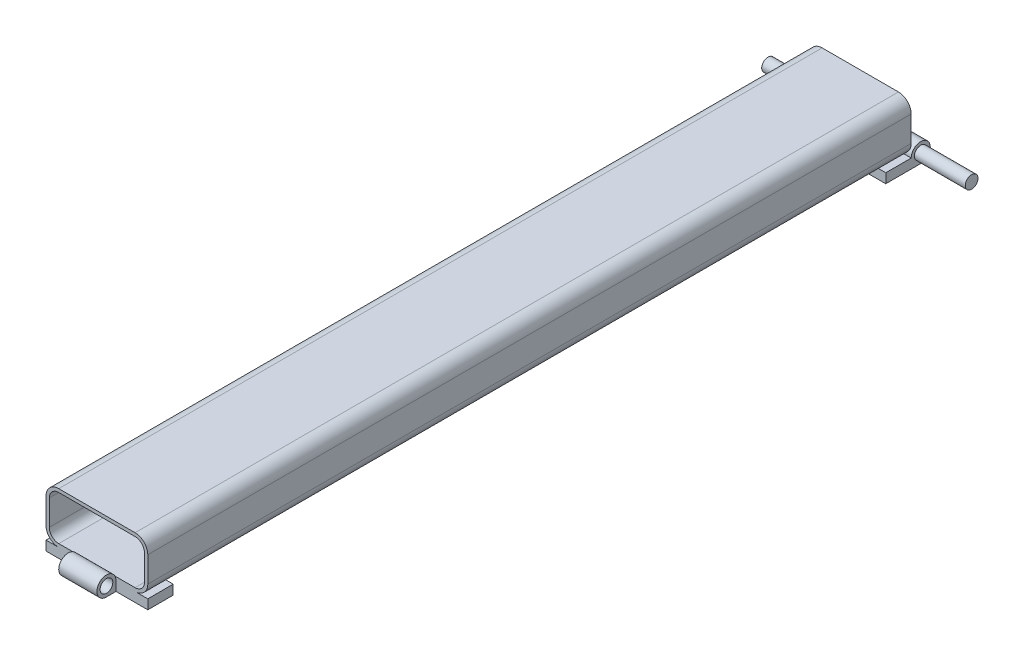
ISO-10303-21;
HEADER;
FILE_DESCRIPTION(('STEP AP214'),'2;1');
FILE_NAME('part.step','',(''),(''),'','','');
FILE_SCHEMA(('AUTOMOTIVE_DESIGN { 1 0 10303 214 1 1 1 1 }'));
ENDSEC;
DATA;
#1=APPLICATION_CONTEXT('core data for automotive mechanical design processes');
#2=APPLICATION_PROTOCOL_DEFINITION('international standard','automotive_design',2000,#1);
#3=PRODUCT_CONTEXT('',#1,'mechanical');
#4=PRODUCT('Part','Part','',(#3));
#5=PRODUCT_RELATED_PRODUCT_CATEGORY('part','',(#4));
#6=PRODUCT_DEFINITION_FORMATION('','',#4);
#7=PRODUCT_DEFINITION_CONTEXT('part definition',#1,'design');
#8=PRODUCT_DEFINITION('design','',#6,#7);
#9=PRODUCT_DEFINITION_SHAPE('','',#8);
#10=(LENGTH_UNIT() NAMED_UNIT(*) SI_UNIT(.MILLI.,.METRE.));
#11=(NAMED_UNIT(*) PLANE_ANGLE_UNIT() SI_UNIT($,.RADIAN.));
#12=(NAMED_UNIT(*) SI_UNIT($,.STERADIAN.) SOLID_ANGLE_UNIT());
#13=UNCERTAINTY_MEASURE_WITH_UNIT(LENGTH_MEASURE(1.E-05),#10,'distance_accuracy_value','');
#14=(GEOMETRIC_REPRESENTATION_CONTEXT(3) GLOBAL_UNCERTAINTY_ASSIGNED_CONTEXT((#13)) GLOBAL_UNIT_ASSIGNED_CONTEXT((#10,
#11,#12)) REPRESENTATION_CONTEXT('',''));
#15=CARTESIAN_POINT('',(0.,0.,0.));
#16=DIRECTION('',(0.,0.,1.));
#17=DIRECTION('',(1.,0.,0.));
#18=AXIS2_PLACEMENT_3D('',#15,#16,#17);
#19=CARTESIAN_POINT('',(-19.05,-12.7,190.5));
#20=DIRECTION('',(0.,1.,0.));
#21=DIRECTION('',(0.,0.,1.));
#22=AXIS2_PLACEMENT_3D('',#19,#20,#21);
#23=PLANE('',#22);
#24=DIRECTION('',(1.,0.,0.));
#25=VECTOR('',#24,1.);
#26=CARTESIAN_POINT('',(-25.4,-12.7,177.8));
#27=LINE('',#26,#25);
#28=CARTESIAN_POINT('',(-19.05,-12.7,177.8));
#29=VERTEX_POINT('',#28);
#30=CARTESIAN_POINT('',(19.05,-12.7,177.8));
#31=VERTEX_POINT('',#30);
#32=EDGE_CURVE('E56',#29,#31,#27,.T.);
#33=ORIENTED_EDGE('',*,*,#32,.F.);
#34=DIRECTION('',(0.,0.,-1.));
#35=VECTOR('',#34,1.);
#36=CARTESIAN_POINT('',(-19.05,-12.7,190.5));
#37=LINE('',#36,#35);
#38=CARTESIAN_POINT('',(-19.05,-12.7,-177.8));
#39=VERTEX_POINT('',#38);
#40=EDGE_CURVE('E429',#29,#39,#37,.T.);
#41=ORIENTED_EDGE('',*,*,#40,.T.);
#42=DIRECTION('',(1.,0.,0.));
#43=VECTOR('',#42,1.);
#44=CARTESIAN_POINT('',(-25.4,-12.7,-177.8));
#45=LINE('',#44,#43);
#46=CARTESIAN_POINT('',(19.05,-12.7,-177.8));
#47=VERTEX_POINT('',#46);
#48=EDGE_CURVE('E312',#39,#47,#45,.T.);
#49=ORIENTED_EDGE('',*,*,#48,.T.);
#50=DIRECTION('',(0.,0.,-1.));
#51=VECTOR('',#50,1.);
#52=CARTESIAN_POINT('',(19.05,-12.7,190.5));
#53=LINE('',#52,#51);
#54=EDGE_CURVE('E430',#31,#47,#53,.T.);
#55=ORIENTED_EDGE('',*,*,#54,.F.);
#56=EDGE_LOOP('',(#33,#41,#49,#55));
#57=FACE_BOUND('',#56,.T.);
#58=ADVANCED_FACE('F32',(#57),#23,.F.);
#59=CARTESIAN_POINT('',(-19.05,-6.35,190.5));
#60=DIRECTION('',(0.,0.,-1.));
#61=DIRECTION('',(-1.,0.,0.));
#62=AXIS2_PLACEMENT_3D('',#59,#60,#61);
#63=PLANE('',#62);
#64=CARTESIAN_POINT('',(-19.05,6.35,190.5));
#65=DIRECTION('',(0.,0.,1.));
#66=DIRECTION('',(-1.,0.,0.));
#67=AXIS2_PLACEMENT_3D('',#64,#65,#66);
#68=CIRCLE('',#67,4.699);
#69=CARTESIAN_POINT('',(-19.05,11.049,190.5));
#70=VERTEX_POINT('',#69);
#71=CARTESIAN_POINT('',(-23.749,6.35,190.5));
#72=VERTEX_POINT('',#71);
#73=EDGE_CURVE('E315',#70,#72,#68,.T.);
#74=ORIENTED_EDGE('',*,*,#73,.F.);
#75=DIRECTION('',(-1.,0.,0.));
#76=VECTOR('',#75,1.);
#77=CARTESIAN_POINT('',(-19.05,11.049,190.5));
#78=LINE('',#77,#76);
#79=CARTESIAN_POINT('',(19.05,11.049,190.5));
#80=VERTEX_POINT('',#79);
#81=EDGE_CURVE('E331',#80,#70,#78,.T.);
#82=ORIENTED_EDGE('',*,*,#81,.F.);
#83=CARTESIAN_POINT('',(19.05,6.35,190.5));
#84=DIRECTION('',(0.,0.,1.));
#85=DIRECTION('',(-1.,0.,0.));
#86=AXIS2_PLACEMENT_3D('',#83,#84,#85);
#87=CIRCLE('',#86,4.699);
#88=CARTESIAN_POINT('',(23.749,6.35,190.5));
#89=VERTEX_POINT('',#88);
#90=EDGE_CURVE('E328',#89,#80,#87,.T.);
#91=ORIENTED_EDGE('',*,*,#90,.F.);
#92=DIRECTION('',(0.,1.,0.));
#93=VECTOR('',#92,1.);
#94=CARTESIAN_POINT('',(23.749,-6.35,190.5));
#95=LINE('',#94,#93);
#96=CARTESIAN_POINT('',(23.749,-6.35,190.5));
#97=VERTEX_POINT('',#96);
#98=EDGE_CURVE('E326',#97,#89,#95,.T.);
#99=ORIENTED_EDGE('',*,*,#98,.F.);
#100=CARTESIAN_POINT('',(19.05,-6.35,190.5));
#101=DIRECTION('',(0.,0.,1.));
#102=DIRECTION('',(1.,0.,0.));
#103=AXIS2_PLACEMENT_3D('',#100,#101,#102);
#104=CIRCLE('',#103,4.699);
#105=CARTESIAN_POINT('',(19.05,-11.049,190.5));
#106=VERTEX_POINT('',#105);
#107=EDGE_CURVE('E324',#106,#97,#104,.T.);
#108=ORIENTED_EDGE('',*,*,#107,.F.);
#109=DIRECTION('',(1.,0.,0.));
#110=VECTOR('',#109,1.);
#111=CARTESIAN_POINT('',(-19.05,-11.049,190.5));
#112=LINE('',#111,#110);
#113=CARTESIAN_POINT('',(-19.05,-11.049,190.5));
#114=VERTEX_POINT('',#113);
#115=EDGE_CURVE('E322',#114,#106,#112,.T.);
#116=ORIENTED_EDGE('',*,*,#115,.F.);
#117=CARTESIAN_POINT('',(-19.05,-6.35,190.5));
#118=DIRECTION('',(0.,0.,1.));
#119=DIRECTION('',(-1.,0.,0.));
#120=AXIS2_PLACEMENT_3D('',#117,#118,#119);
#121=CIRCLE('',#120,4.699);
#122=CARTESIAN_POINT('',(-23.749,-6.35,190.5));
#123=VERTEX_POINT('',#122);
#124=EDGE_CURVE('E320',#123,#114,#121,.T.);
#125=ORIENTED_EDGE('',*,*,#124,.F.);
#126=DIRECTION('',(0.,-1.,0.));
#127=VECTOR('',#126,1.);
#128=CARTESIAN_POINT('',(-23.749,-6.35,190.5));
#129=LINE('',#128,#127);
#130=EDGE_CURVE('E317',#72,#123,#129,.T.);
#131=ORIENTED_EDGE('',*,*,#130,.F.);
#132=EDGE_LOOP('',(#74,#82,#91,#99,#108,#116,#125,#131));
#133=FACE_BOUND('',#132,.T.);
#134=DIRECTION('',(-1.,0.,0.));
#135=VECTOR('',#134,1.);
#136=CARTESIAN_POINT('',(-19.05,12.7,190.5));
#137=LINE('',#136,#135);
#138=CARTESIAN_POINT('',(19.05,12.7,190.5));
#139=VERTEX_POINT('',#138);
#140=CARTESIAN_POINT('',(-19.05,12.7,190.5));
#141=VERTEX_POINT('',#140);
#142=EDGE_CURVE('E386',#139,#141,#137,.T.);
#143=ORIENTED_EDGE('',*,*,#142,.T.);
#144=CARTESIAN_POINT('',(-19.05,6.35,190.5));
#145=DIRECTION('',(0.,0.,1.));
#146=DIRECTION('',(-1.,0.,0.));
#147=AXIS2_PLACEMENT_3D('',#144,#145,#146);
#148=CIRCLE('',#147,6.35);
#149=CARTESIAN_POINT('',(-25.4,6.35,190.5));
#150=VERTEX_POINT('',#149);
#151=EDGE_CURVE('E388',#141,#150,#148,.T.);
#152=ORIENTED_EDGE('',*,*,#151,.T.);
#153=DIRECTION('',(0.,-1.,0.));
#154=VECTOR('',#153,1.);
#155=CARTESIAN_POINT('',(-25.4,-6.35,190.5));
#156=LINE('',#155,#154);
#157=CARTESIAN_POINT('',(-25.4,-6.35,190.5));
#158=VERTEX_POINT('',#157);
#159=EDGE_CURVE('E390',#150,#158,#156,.T.);
#160=ORIENTED_EDGE('',*,*,#159,.T.);
#161=CARTESIAN_POINT('',(-19.05,-6.35,190.5));
#162=DIRECTION('',(0.,0.,1.));
#163=DIRECTION('',(-1.,0.,0.));
#164=AXIS2_PLACEMENT_3D('',#161,#162,#163);
#165=CIRCLE('',#164,6.35);
#166=CARTESIAN_POINT('',(-19.05,-12.7,190.5));
#167=VERTEX_POINT('',#166);
#168=EDGE_CURVE('E374',#158,#167,#165,.T.);
#169=ORIENTED_EDGE('',*,*,#168,.T.);
#170=DIRECTION('',(1.,0.,0.));
#171=VECTOR('',#170,1.);
#172=CARTESIAN_POINT('',(-25.4,-12.7,190.5));
#173=LINE('',#172,#171);
#174=CARTESIAN_POINT('',(-25.4,-12.7,190.5));
#175=VERTEX_POINT('',#174);
#176=EDGE_CURVE('E231',#175,#167,#173,.T.);
#177=ORIENTED_EDGE('',*,*,#176,.F.);
#178=DIRECTION('',(0.,1.,0.));
#179=VECTOR('',#178,1.);
#180=CARTESIAN_POINT('',(-25.4,-12.7,190.5));
#181=LINE('',#180,#179);
#182=CARTESIAN_POINT('',(-25.4,-17.4625000000001,190.5));
#183=VERTEX_POINT('',#182);
#184=EDGE_CURVE('E224',#183,#175,#181,.T.);
#185=ORIENTED_EDGE('',*,*,#184,.F.);
#186=DIRECTION('',(1.,0.,0.));
#187=VECTOR('',#186,1.);
#188=CARTESIAN_POINT('',(-9.525,-17.4625000000001,190.5));
#189=LINE('',#188,#187);
#190=CARTESIAN_POINT('',(-9.525,-17.4625000000001,190.5));
#191=VERTEX_POINT('',#190);
#192=EDGE_CURVE('E228',#183,#191,#189,.T.);
#193=ORIENTED_EDGE('',*,*,#192,.T.);
#194=DIRECTION('',(0.,-1.,0.));
#195=VECTOR('',#194,1.);
#196=CARTESIAN_POINT('',(-9.525,12.7,190.5));
#197=LINE('',#196,#195);
#198=CARTESIAN_POINT('',(-9.525,-12.7,190.5));
#199=VERTEX_POINT('',#198);
#200=EDGE_CURVE('E448',#199,#191,#197,.T.);
#201=ORIENTED_EDGE('',*,*,#200,.F.);
#202=DIRECTION('',(1.,0.,0.));
#203=VECTOR('',#202,1.);
#204=CARTESIAN_POINT('',(-19.05,-12.7,190.5));
#205=LINE('',#204,#203);
#206=CARTESIAN_POINT('',(9.525,-12.7,190.5));
#207=VERTEX_POINT('',#206);
#208=EDGE_CURVE('E376',#199,#207,#205,.T.);
#209=ORIENTED_EDGE('',*,*,#208,.T.);
#210=DIRECTION('',(0.,-1.,0.));
#211=VECTOR('',#210,1.);
#212=CARTESIAN_POINT('',(9.525,12.7,190.5));
#213=LINE('',#212,#211);
#214=CARTESIAN_POINT('',(9.525,-17.4625000000001,190.5));
#215=VERTEX_POINT('',#214);
#216=EDGE_CURVE('E245',#207,#215,#213,.T.);
#217=ORIENTED_EDGE('',*,*,#216,.T.);
#218=DIRECTION('',(1.,0.,0.));
#219=VECTOR('',#218,1.);
#220=CARTESIAN_POINT('',(25.4,-17.4625000000001,190.5));
#221=LINE('',#220,#219);
#222=CARTESIAN_POINT('',(25.4,-17.4625,190.5));
#223=VERTEX_POINT('',#222);
#224=EDGE_CURVE('E48',#215,#223,#221,.T.);
#225=ORIENTED_EDGE('',*,*,#224,.T.);
#226=DIRECTION('',(0.,1.,0.));
#227=VECTOR('',#226,1.);
#228=CARTESIAN_POINT('',(25.4,-12.7,190.5));
#229=LINE('',#228,#227);
#230=CARTESIAN_POINT('',(25.4,-12.7,190.5));
#231=VERTEX_POINT('',#230);
#232=EDGE_CURVE('E236',#223,#231,#229,.T.);
#233=ORIENTED_EDGE('',*,*,#232,.T.);
#234=CARTESIAN_POINT('',(19.05,-12.7,190.5));
#235=VERTEX_POINT('',#234);
#236=EDGE_CURVE('E252',#235,#231,#173,.T.);
#237=ORIENTED_EDGE('',*,*,#236,.F.);
#238=CARTESIAN_POINT('',(19.05,-6.35,190.5));
#239=DIRECTION('',(0.,0.,1.));
#240=DIRECTION('',(1.,0.,0.));
#241=AXIS2_PLACEMENT_3D('',#238,#239,#240);
#242=CIRCLE('',#241,6.35);
#243=CARTESIAN_POINT('',(25.4,-6.35,190.5));
#244=VERTEX_POINT('',#243);
#245=EDGE_CURVE('E380',#235,#244,#242,.T.);
#246=ORIENTED_EDGE('',*,*,#245,.T.);
#247=DIRECTION('',(0.,1.,0.));
#248=VECTOR('',#247,1.);
#249=CARTESIAN_POINT('',(25.4,-6.35,190.5));
#250=LINE('',#249,#248);
#251=CARTESIAN_POINT('',(25.4,6.35,190.5));
#252=VERTEX_POINT('',#251);
#253=EDGE_CURVE('E382',#244,#252,#250,.T.);
#254=ORIENTED_EDGE('',*,*,#253,.T.);
#255=CARTESIAN_POINT('',(19.05,6.35,190.5));
#256=DIRECTION('',(0.,0.,1.));
#257=DIRECTION('',(-1.,0.,0.));
#258=AXIS2_PLACEMENT_3D('',#255,#256,#257);
#259=CIRCLE('',#258,6.35);
#260=EDGE_CURVE('E384',#252,#139,#259,.T.);
#261=ORIENTED_EDGE('',*,*,#260,.T.);
#262=EDGE_LOOP('',(#143,#152,#160,#169,#177,#185,#193,#201,#209,#217,#225,#233,#237,#246,#254,#261));
#263=FACE_BOUND('',#262,.T.);
#264=ADVANCED_FACE('F226',(#133,#263),#63,.F.);
#265=CARTESIAN_POINT('',(-19.05,-6.35,-190.5));
#266=DIRECTION('',(0.,0.,-1.));
#267=DIRECTION('',(-1.,0.,0.));
#268=AXIS2_PLACEMENT_3D('',#265,#266,#267);
#269=PLANE('',#268);
#270=CARTESIAN_POINT('',(-19.05,-6.35,-190.5));
#271=DIRECTION('',(0.,0.,1.));
#272=DIRECTION('',(-1.,0.,0.));
#273=AXIS2_PLACEMENT_3D('',#270,#271,#272);
#274=CIRCLE('',#273,6.35);
#275=CARTESIAN_POINT('',(-25.4,-6.35,-190.5));
#276=VERTEX_POINT('',#275);
#277=CARTESIAN_POINT('',(-19.05,-12.7,-190.5));
#278=VERTEX_POINT('',#277);
#279=EDGE_CURVE('E373',#276,#278,#274,.T.);
#280=ORIENTED_EDGE('',*,*,#279,.F.);
#281=DIRECTION('',(0.,-1.,0.));
#282=VECTOR('',#281,1.);
#283=CARTESIAN_POINT('',(-25.4,-6.35,-190.5));
#284=LINE('',#283,#282);
#285=CARTESIAN_POINT('',(-25.4,6.35,-190.5));
#286=VERTEX_POINT('',#285);
#287=EDGE_CURVE('E377',#286,#276,#284,.T.);
#288=ORIENTED_EDGE('',*,*,#287,.F.);
#289=CARTESIAN_POINT('',(-19.05,6.35,-190.5));
#290=DIRECTION('',(0.,0.,1.));
#291=DIRECTION('',(-1.,0.,0.));
#292=AXIS2_PLACEMENT_3D('',#289,#290,#291);
#293=CIRCLE('',#292,6.35);
#294=CARTESIAN_POINT('',(-19.05,12.7,-190.5));
#295=VERTEX_POINT('',#294);
#296=EDGE_CURVE('E405',#295,#286,#293,.T.);
#297=ORIENTED_EDGE('',*,*,#296,.F.);
#298=DIRECTION('',(-1.,0.,0.));
#299=VECTOR('',#298,1.);
#300=CARTESIAN_POINT('',(-19.05,12.7,-190.5));
#301=LINE('',#300,#299);
#302=CARTESIAN_POINT('',(19.05,12.7,-190.5));
#303=VERTEX_POINT('',#302);
#304=EDGE_CURVE('E403',#303,#295,#301,.T.);
#305=ORIENTED_EDGE('',*,*,#304,.F.);
#306=CARTESIAN_POINT('',(19.05,6.35,-190.5));
#307=DIRECTION('',(0.,0.,1.));
#308=DIRECTION('',(-1.,0.,0.));
#309=AXIS2_PLACEMENT_3D('',#306,#307,#308);
#310=CIRCLE('',#309,6.35);
#311=CARTESIAN_POINT('',(25.4,6.35,-190.5));
#312=VERTEX_POINT('',#311);
#313=EDGE_CURVE('E401',#312,#303,#310,.T.);
#314=ORIENTED_EDGE('',*,*,#313,.F.);
#315=DIRECTION('',(0.,1.,0.));
#316=VECTOR('',#315,1.);
#317=CARTESIAN_POINT('',(25.4,-6.35,-190.5));
#318=LINE('',#317,#316);
#319=CARTESIAN_POINT('',(25.4,-6.35,-190.5));
#320=VERTEX_POINT('',#319);
#321=EDGE_CURVE('E399',#320,#312,#318,.T.);
#322=ORIENTED_EDGE('',*,*,#321,.F.);
#323=CARTESIAN_POINT('',(19.05,-6.35,-190.5));
#324=DIRECTION('',(0.,0.,1.));
#325=DIRECTION('',(1.,0.,0.));
#326=AXIS2_PLACEMENT_3D('',#323,#324,#325);
#327=CIRCLE('',#326,6.35);
#328=CARTESIAN_POINT('',(19.05,-12.7,-190.5));
#329=VERTEX_POINT('',#328);
#330=EDGE_CURVE('E397',#329,#320,#327,.T.);
#331=ORIENTED_EDGE('',*,*,#330,.F.);
#332=DIRECTION('',(1.,0.,0.));
#333=VECTOR('',#332,1.);
#334=CARTESIAN_POINT('',(-19.05,-12.7,-190.5));
#335=LINE('',#334,#333);
#336=EDGE_CURVE('E395',#278,#329,#335,.T.);
#337=ORIENTED_EDGE('',*,*,#336,.F.);
#338=EDGE_LOOP('',(#280,#288,#297,#305,#314,#322,#331,#337));
#339=FACE_BOUND('',#338,.T.);
#340=DIRECTION('',(-1.,0.,0.));
#341=VECTOR('',#340,1.);
#342=CARTESIAN_POINT('',(-19.05,11.049,-190.5));
#343=LINE('',#342,#341);
#344=CARTESIAN_POINT('',(19.05,11.049,-190.5));
#345=VERTEX_POINT('',#344);
#346=CARTESIAN_POINT('',(-19.05,11.049,-190.5));
#347=VERTEX_POINT('',#346);
#348=EDGE_CURVE('E318',#345,#347,#343,.T.);
#349=ORIENTED_EDGE('',*,*,#348,.T.);
#350=CARTESIAN_POINT('',(-19.05,6.35,-190.5));
#351=DIRECTION('',(0.,0.,1.));
#352=DIRECTION('',(-1.,0.,0.));
#353=AXIS2_PLACEMENT_3D('',#350,#351,#352);
#354=CIRCLE('',#353,4.699);
#355=CARTESIAN_POINT('',(-23.749,6.35,-190.5));
#356=VERTEX_POINT('',#355);
#357=EDGE_CURVE('E314',#347,#356,#354,.T.);
#358=ORIENTED_EDGE('',*,*,#357,.T.);
#359=DIRECTION('',(0.,-1.,0.));
#360=VECTOR('',#359,1.);
#361=CARTESIAN_POINT('',(-23.749,-6.35,-190.5));
#362=LINE('',#361,#360);
#363=CARTESIAN_POINT('',(-23.749,-6.35,-190.5));
#364=VERTEX_POINT('',#363);
#365=EDGE_CURVE('E336',#356,#364,#362,.T.);
#366=ORIENTED_EDGE('',*,*,#365,.T.);
#367=CARTESIAN_POINT('',(-19.05,-6.35,-190.5));
#368=DIRECTION('',(0.,0.,1.));
#369=DIRECTION('',(-1.,0.,0.));
#370=AXIS2_PLACEMENT_3D('',#367,#368,#369);
#371=CIRCLE('',#370,4.699);
#372=CARTESIAN_POINT('',(-19.05,-11.049,-190.5));
#373=VERTEX_POINT('',#372);
#374=EDGE_CURVE('E339',#364,#373,#371,.T.);
#375=ORIENTED_EDGE('',*,*,#374,.T.);
#376=DIRECTION('',(1.,0.,0.));
#377=VECTOR('',#376,1.);
#378=CARTESIAN_POINT('',(-19.05,-11.049,-190.5));
#379=LINE('',#378,#377);
#380=CARTESIAN_POINT('',(19.05,-11.049,-190.5));
#381=VERTEX_POINT('',#380);
#382=EDGE_CURVE('E342',#373,#381,#379,.T.);
#383=ORIENTED_EDGE('',*,*,#382,.T.);
#384=CARTESIAN_POINT('',(19.05,-6.35,-190.5));
#385=DIRECTION('',(0.,0.,1.));
#386=DIRECTION('',(1.,0.,0.));
#387=AXIS2_PLACEMENT_3D('',#384,#385,#386);
#388=CIRCLE('',#387,4.699);
#389=CARTESIAN_POINT('',(23.749,-6.35,-190.5));
#390=VERTEX_POINT('',#389);
#391=EDGE_CURVE('E345',#381,#390,#388,.T.);
#392=ORIENTED_EDGE('',*,*,#391,.T.);
#393=DIRECTION('',(0.,1.,0.));
#394=VECTOR('',#393,1.);
#395=CARTESIAN_POINT('',(23.749,-6.35,-190.5));
#396=LINE('',#395,#394);
#397=CARTESIAN_POINT('',(23.749,6.35,-190.5));
#398=VERTEX_POINT('',#397);
#399=EDGE_CURVE('E348',#390,#398,#396,.T.);
#400=ORIENTED_EDGE('',*,*,#399,.T.);
#401=CARTESIAN_POINT('',(19.05,6.35,-190.5));
#402=DIRECTION('',(0.,0.,1.));
#403=DIRECTION('',(-1.,0.,0.));
#404=AXIS2_PLACEMENT_3D('',#401,#402,#403);
#405=CIRCLE('',#404,4.699);
#406=EDGE_CURVE('E351',#398,#345,#405,.T.);
#407=ORIENTED_EDGE('',*,*,#406,.T.);
#408=EDGE_LOOP('',(#349,#358,#366,#375,#383,#392,#400,#407));
#409=FACE_BOUND('',#408,.T.);
#410=ADVANCED_FACE('F497',(#339,#409),#269,.T.);
#411=CARTESIAN_POINT('',(-19.05,-6.35,190.5));
#412=DIRECTION('',(0.,0.,-1.));
#413=DIRECTION('',(-1.,0.,0.));
#414=AXIS2_PLACEMENT_3D('',#411,#412,#413);
#415=CYLINDRICAL_SURFACE('',#414,6.35);
#416=ORIENTED_EDGE('',*,*,#279,.T.);
#417=DIRECTION('',(0.,0.,-1.));
#418=VECTOR('',#417,1.);
#419=CARTESIAN_POINT('',(-19.05,-12.7,190.5));
#420=LINE('',#419,#418);
#421=EDGE_CURVE('E303',#39,#278,#420,.T.);
#422=ORIENTED_EDGE('',*,*,#421,.F.);
#423=ORIENTED_EDGE('',*,*,#40,.F.);
#424=EDGE_CURVE('E431',#167,#29,#37,.T.);
#425=ORIENTED_EDGE('',*,*,#424,.F.);
#426=ORIENTED_EDGE('',*,*,#168,.F.);
#427=DIRECTION('',(0.,0.,-1.));
#428=VECTOR('',#427,1.);
#429=CARTESIAN_POINT('',(-25.4,-6.35,190.5));
#430=LINE('',#429,#428);
#431=EDGE_CURVE('E392',#158,#276,#430,.T.);
#432=ORIENTED_EDGE('',*,*,#431,.T.);
#433=EDGE_LOOP('',(#416,#422,#423,#425,#426,#432));
#434=FACE_BOUND('',#433,.T.);
#435=ADVANCED_FACE('F34',(#434),#415,.T.);
#436=CARTESIAN_POINT('',(19.05,-6.35,190.5));
#437=DIRECTION('',(0.,0.,-1.));
#438=DIRECTION('',(-1.,0.,0.));
#439=AXIS2_PLACEMENT_3D('',#436,#437,#438);
#440=CYLINDRICAL_SURFACE('',#439,6.35);
#441=ORIENTED_EDGE('',*,*,#330,.T.);
#442=DIRECTION('',(0.,0.,-1.));
#443=VECTOR('',#442,1.);
#444=CARTESIAN_POINT('',(25.4,-6.35,190.5));
#445=LINE('',#444,#443);
#446=EDGE_CURVE('E422',#244,#320,#445,.T.);
#447=ORIENTED_EDGE('',*,*,#446,.F.);
#448=ORIENTED_EDGE('',*,*,#245,.F.);
#449=EDGE_CURVE('E426',#235,#31,#53,.T.);
#450=ORIENTED_EDGE('',*,*,#449,.T.);
#451=ORIENTED_EDGE('',*,*,#54,.T.);
#452=EDGE_CURVE('E425',#47,#329,#53,.T.);
#453=ORIENTED_EDGE('',*,*,#452,.T.);
#454=EDGE_LOOP('',(#441,#447,#448,#450,#451,#453));
#455=FACE_BOUND('',#454,.T.);
#456=ADVANCED_FACE('F509',(#455),#440,.T.);
#457=CARTESIAN_POINT('',(25.4,-6.35,190.5));
#458=DIRECTION('',(-1.,0.,0.));
#459=DIRECTION('',(0.,0.,1.));
#460=AXIS2_PLACEMENT_3D('',#457,#458,#459);
#461=PLANE('',#460);
#462=ORIENTED_EDGE('',*,*,#321,.T.);
#463=DIRECTION('',(0.,0.,-1.));
#464=VECTOR('',#463,1.);
#465=CARTESIAN_POINT('',(25.4,6.35,190.5));
#466=LINE('',#465,#464);
#467=EDGE_CURVE('E419',#252,#312,#466,.T.);
#468=ORIENTED_EDGE('',*,*,#467,.F.);
#469=ORIENTED_EDGE('',*,*,#253,.F.);
#470=ORIENTED_EDGE('',*,*,#446,.T.);
#471=EDGE_LOOP('',(#462,#468,#469,#470));
#472=FACE_BOUND('',#471,.T.);
#473=ADVANCED_FACE('F536',(#472),#461,.F.);
#474=CARTESIAN_POINT('',(19.05,6.35,190.5));
#475=DIRECTION('',(0.,0.,-1.));
#476=DIRECTION('',(-1.,0.,0.));
#477=AXIS2_PLACEMENT_3D('',#474,#475,#476);
#478=CYLINDRICAL_SURFACE('',#477,6.35);
#479=ORIENTED_EDGE('',*,*,#313,.T.);
#480=DIRECTION('',(0.,0.,-1.));
#481=VECTOR('',#480,1.);
#482=CARTESIAN_POINT('',(19.05,12.7,190.5));
#483=LINE('',#482,#481);
#484=EDGE_CURVE('E416',#139,#303,#483,.T.);
#485=ORIENTED_EDGE('',*,*,#484,.F.);
#486=ORIENTED_EDGE('',*,*,#260,.F.);
#487=ORIENTED_EDGE('',*,*,#467,.T.);
#488=EDGE_LOOP('',(#479,#485,#486,#487));
#489=FACE_BOUND('',#488,.T.);
#490=ADVANCED_FACE('F539',(#489),#478,.T.);
#491=CARTESIAN_POINT('',(-19.05,12.7,190.5));
#492=DIRECTION('',(0.,-1.,0.));
#493=DIRECTION('',(0.,0.,-1.));
#494=AXIS2_PLACEMENT_3D('',#491,#492,#493);
#495=PLANE('',#494);
#496=ORIENTED_EDGE('',*,*,#304,.T.);
#497=DIRECTION('',(0.,0.,-1.));
#498=VECTOR('',#497,1.);
#499=CARTESIAN_POINT('',(-19.05,12.7,190.5));
#500=LINE('',#499,#498);
#501=EDGE_CURVE('E413',#141,#295,#500,.T.);
#502=ORIENTED_EDGE('',*,*,#501,.F.);
#503=ORIENTED_EDGE('',*,*,#142,.F.);
#504=ORIENTED_EDGE('',*,*,#484,.T.);
#505=EDGE_LOOP('',(#496,#502,#503,#504));
#506=FACE_BOUND('',#505,.T.);
#507=ADVANCED_FACE('F543',(#506),#495,.F.);
#508=CARTESIAN_POINT('',(-19.05,6.35,190.5));
#509=DIRECTION('',(0.,0.,-1.));
#510=DIRECTION('',(-1.,0.,0.));
#511=AXIS2_PLACEMENT_3D('',#508,#509,#510);
#512=CYLINDRICAL_SURFACE('',#511,6.35);
#513=ORIENTED_EDGE('',*,*,#296,.T.);
#514=DIRECTION('',(0.,0.,-1.));
#515=VECTOR('',#514,1.);
#516=CARTESIAN_POINT('',(-25.4,6.35,190.5));
#517=LINE('',#516,#515);
#518=EDGE_CURVE('E410',#150,#286,#517,.T.);
#519=ORIENTED_EDGE('',*,*,#518,.F.);
#520=ORIENTED_EDGE('',*,*,#151,.F.);
#521=ORIENTED_EDGE('',*,*,#501,.T.);
#522=EDGE_LOOP('',(#513,#519,#520,#521));
#523=FACE_BOUND('',#522,.T.);
#524=ADVANCED_FACE('F547',(#523),#512,.T.);
#525=CARTESIAN_POINT('',(-25.4,-6.35,190.5));
#526=DIRECTION('',(1.,0.,0.));
#527=DIRECTION('',(0.,0.,-1.));
#528=AXIS2_PLACEMENT_3D('',#525,#526,#527);
#529=PLANE('',#528);
#530=ORIENTED_EDGE('',*,*,#287,.T.);
#531=ORIENTED_EDGE('',*,*,#431,.F.);
#532=ORIENTED_EDGE('',*,*,#159,.F.);
#533=ORIENTED_EDGE('',*,*,#518,.T.);
#534=EDGE_LOOP('',(#530,#531,#532,#533));
#535=FACE_BOUND('',#534,.T.);
#536=ADVANCED_FACE('F551',(#535),#529,.F.);
#537=CARTESIAN_POINT('',(-19.05,6.35,190.5));
#538=DIRECTION('',(0.,0.,-1.));
#539=DIRECTION('',(-1.,0.,0.));
#540=AXIS2_PLACEMENT_3D('',#537,#538,#539);
#541=CYLINDRICAL_SURFACE('',#540,4.699);
#542=ORIENTED_EDGE('',*,*,#357,.F.);
#543=DIRECTION('',(0.,0.,-1.));
#544=VECTOR('',#543,1.);
#545=CARTESIAN_POINT('',(-19.05,11.049,190.5));
#546=LINE('',#545,#544);
#547=EDGE_CURVE('E333',#70,#347,#546,.T.);
#548=ORIENTED_EDGE('',*,*,#547,.F.);
#549=ORIENTED_EDGE('',*,*,#73,.T.);
#550=DIRECTION('',(0.,0.,-1.));
#551=VECTOR('',#550,1.);
#552=CARTESIAN_POINT('',(-23.749,6.35,190.5));
#553=LINE('',#552,#551);
#554=EDGE_CURVE('E370',#72,#356,#553,.T.);
#555=ORIENTED_EDGE('',*,*,#554,.T.);
#556=EDGE_LOOP('',(#542,#548,#549,#555));
#557=FACE_BOUND('',#556,.T.);
#558=ADVANCED_FACE('F555',(#557),#541,.F.);
#559=CARTESIAN_POINT('',(-23.749,-6.35,190.5));
#560=DIRECTION('',(1.,0.,0.));
#561=DIRECTION('',(0.,0.,-1.));
#562=AXIS2_PLACEMENT_3D('',#559,#560,#561);
#563=PLANE('',#562);
#564=ORIENTED_EDGE('',*,*,#365,.F.);
#565=ORIENTED_EDGE('',*,*,#554,.F.);
#566=ORIENTED_EDGE('',*,*,#130,.T.);
#567=DIRECTION('',(0.,0.,-1.));
#568=VECTOR('',#567,1.);
#569=CARTESIAN_POINT('',(-23.749,-6.35,190.5));
#570=LINE('',#569,#568);
#571=EDGE_CURVE('E368',#123,#364,#570,.T.);
#572=ORIENTED_EDGE('',*,*,#571,.T.);
#573=EDGE_LOOP('',(#564,#565,#566,#572));
#574=FACE_BOUND('',#573,.T.);
#575=ADVANCED_FACE('F561',(#574),#563,.T.);
#576=CARTESIAN_POINT('',(-19.05,-6.35,190.5));
#577=DIRECTION('',(0.,0.,-1.));
#578=DIRECTION('',(-1.,0.,0.));
#579=AXIS2_PLACEMENT_3D('',#576,#577,#578);
#580=CYLINDRICAL_SURFACE('',#579,4.699);
#581=ORIENTED_EDGE('',*,*,#374,.F.);
#582=ORIENTED_EDGE('',*,*,#571,.F.);
#583=ORIENTED_EDGE('',*,*,#124,.T.);
#584=DIRECTION('',(0.,0.,-1.));
#585=VECTOR('',#584,1.);
#586=CARTESIAN_POINT('',(-19.05,-11.049,190.5));
#587=LINE('',#586,#585);
#588=EDGE_CURVE('E366',#114,#373,#587,.T.);
#589=ORIENTED_EDGE('',*,*,#588,.T.);
#590=EDGE_LOOP('',(#581,#582,#583,#589));
#591=FACE_BOUND('',#590,.T.);
#592=ADVANCED_FACE('F565',(#591),#580,.F.);
#593=CARTESIAN_POINT('',(-19.05,-11.049,190.5));
#594=DIRECTION('',(0.,1.,0.));
#595=DIRECTION('',(0.,0.,1.));
#596=AXIS2_PLACEMENT_3D('',#593,#594,#595);
#597=PLANE('',#596);
#598=ORIENTED_EDGE('',*,*,#382,.F.);
#599=ORIENTED_EDGE('',*,*,#588,.F.);
#600=ORIENTED_EDGE('',*,*,#115,.T.);
#601=DIRECTION('',(0.,0.,-1.));
#602=VECTOR('',#601,1.);
#603=CARTESIAN_POINT('',(19.05,-11.049,190.5));
#604=LINE('',#603,#602);
#605=EDGE_CURVE('E364',#106,#381,#604,.T.);
#606=ORIENTED_EDGE('',*,*,#605,.T.);
#607=EDGE_LOOP('',(#598,#599,#600,#606));
#608=FACE_BOUND('',#607,.T.);
#609=ADVANCED_FACE('F569',(#608),#597,.T.);
#610=CARTESIAN_POINT('',(19.05,-6.35,190.5));
#611=DIRECTION('',(0.,0.,-1.));
#612=DIRECTION('',(-1.,0.,0.));
#613=AXIS2_PLACEMENT_3D('',#610,#611,#612);
#614=CYLINDRICAL_SURFACE('',#613,4.699);
#615=ORIENTED_EDGE('',*,*,#391,.F.);
#616=ORIENTED_EDGE('',*,*,#605,.F.);
#617=ORIENTED_EDGE('',*,*,#107,.T.);
#618=DIRECTION('',(0.,0.,-1.));
#619=VECTOR('',#618,1.);
#620=CARTESIAN_POINT('',(23.749,-6.35,190.5));
#621=LINE('',#620,#619);
#622=EDGE_CURVE('E362',#97,#390,#621,.T.);
#623=ORIENTED_EDGE('',*,*,#622,.T.);
#624=EDGE_LOOP('',(#615,#616,#617,#623));
#625=FACE_BOUND('',#624,.T.);
#626=ADVANCED_FACE('F573',(#625),#614,.F.);
#627=CARTESIAN_POINT('',(23.749,-6.35,190.5));
#628=DIRECTION('',(-1.,0.,0.));
#629=DIRECTION('',(0.,-1.,0.));
#630=AXIS2_PLACEMENT_3D('',#627,#628,#629);
#631=PLANE('',#630);
#632=ORIENTED_EDGE('',*,*,#399,.F.);
#633=ORIENTED_EDGE('',*,*,#622,.F.);
#634=ORIENTED_EDGE('',*,*,#98,.T.);
#635=DIRECTION('',(0.,0.,-1.));
#636=VECTOR('',#635,1.);
#637=CARTESIAN_POINT('',(23.749,6.35,190.5));
#638=LINE('',#637,#636);
#639=EDGE_CURVE('E360',#89,#398,#638,.T.);
#640=ORIENTED_EDGE('',*,*,#639,.T.);
#641=EDGE_LOOP('',(#632,#633,#634,#640));
#642=FACE_BOUND('',#641,.T.);
#643=ADVANCED_FACE('F577',(#642),#631,.T.);
#644=CARTESIAN_POINT('',(19.05,6.35,190.5));
#645=DIRECTION('',(0.,0.,-1.));
#646=DIRECTION('',(-1.,0.,0.));
#647=AXIS2_PLACEMENT_3D('',#644,#645,#646);
#648=CYLINDRICAL_SURFACE('',#647,4.699);
#649=ORIENTED_EDGE('',*,*,#406,.F.);
#650=ORIENTED_EDGE('',*,*,#639,.F.);
#651=ORIENTED_EDGE('',*,*,#90,.T.);
#652=DIRECTION('',(0.,0.,-1.));
#653=VECTOR('',#652,1.);
#654=CARTESIAN_POINT('',(19.05,11.049,190.5));
#655=LINE('',#654,#653);
#656=EDGE_CURVE('E358',#80,#345,#655,.T.);
#657=ORIENTED_EDGE('',*,*,#656,.T.);
#658=EDGE_LOOP('',(#649,#650,#651,#657));
#659=FACE_BOUND('',#658,.T.);
#660=ADVANCED_FACE('F581',(#659),#648,.F.);
#661=CARTESIAN_POINT('',(-19.05,11.049,190.5));
#662=DIRECTION('',(0.,-1.,0.));
#663=DIRECTION('',(0.,0.,-1.));
#664=AXIS2_PLACEMENT_3D('',#661,#662,#663);
#665=PLANE('',#664);
#666=ORIENTED_EDGE('',*,*,#348,.F.);
#667=ORIENTED_EDGE('',*,*,#656,.F.);
#668=ORIENTED_EDGE('',*,*,#81,.T.);
#669=ORIENTED_EDGE('',*,*,#547,.T.);
#670=EDGE_LOOP('',(#666,#667,#668,#669));
#671=FACE_BOUND('',#670,.T.);
#672=ADVANCED_FACE('F585',(#671),#665,.T.);
#673=CARTESIAN_POINT('',(-25.4,-12.7,-190.5));
#674=DIRECTION('',(0.,1.,0.));
#675=DIRECTION('',(0.,0.,1.));
#676=AXIS2_PLACEMENT_3D('',#673,#674,#675);
#677=PLANE('',#676);
#678=ORIENTED_EDGE('',*,*,#452,.F.);
#679=CARTESIAN_POINT('',(25.4,-12.7,-177.8));
#680=VERTEX_POINT('',#679);
#681=EDGE_CURVE('E289',#47,#680,#45,.T.);
#682=ORIENTED_EDGE('',*,*,#681,.T.);
#683=DIRECTION('',(0.,0.,1.));
#684=VECTOR('',#683,1.);
#685=CARTESIAN_POINT('',(25.4,-12.7,-190.5));
#686=LINE('',#685,#684);
#687=CARTESIAN_POINT('',(25.4,-12.7,-190.5));
#688=VERTEX_POINT('',#687);
#689=EDGE_CURVE('E268',#688,#680,#686,.T.);
#690=ORIENTED_EDGE('',*,*,#689,.F.);
#691=DIRECTION('',(1.,0.,0.));
#692=VECTOR('',#691,1.);
#693=CARTESIAN_POINT('',(-25.4,-12.7,-190.5));
#694=LINE('',#693,#692);
#695=EDGE_CURVE('E304',#329,#688,#694,.T.);
#696=ORIENTED_EDGE('',*,*,#695,.F.);
#697=EDGE_LOOP('',(#678,#682,#690,#696));
#698=FACE_BOUND('',#697,.T.);
#699=ADVANCED_FACE('F507',(#698),#677,.T.);
#700=CARTESIAN_POINT('',(-25.4,-12.7,-177.8));
#701=VERTEX_POINT('',#700);
#702=EDGE_CURVE('E309',#701,#39,#45,.T.);
#703=ORIENTED_EDGE('',*,*,#702,.T.);
#704=ORIENTED_EDGE('',*,*,#421,.T.);
#705=CARTESIAN_POINT('',(-25.4,-12.7,-190.5));
#706=VERTEX_POINT('',#705);
#707=EDGE_CURVE('E300',#706,#278,#694,.T.);
#708=ORIENTED_EDGE('',*,*,#707,.F.);
#709=DIRECTION('',(0.,0.,1.));
#710=VECTOR('',#709,1.);
#711=CARTESIAN_POINT('',(-25.4,-12.7,-190.5));
#712=LINE('',#711,#710);
#713=EDGE_CURVE('E276',#706,#701,#712,.T.);
#714=ORIENTED_EDGE('',*,*,#713,.T.);
#715=EDGE_LOOP('',(#703,#704,#708,#714));
#716=FACE_BOUND('',#715,.T.);
#717=ADVANCED_FACE('F488',(#716),#677,.T.);
#718=CARTESIAN_POINT('',(-25.4,-12.7,-195.2625));
#719=DIRECTION('',(1.,0.,0.));
#720=DIRECTION('',(0.,0.,-1.));
#721=AXIS2_PLACEMENT_3D('',#718,#719,#720);
#722=CYLINDRICAL_SURFACE('',#721,4.7625);
#723=CARTESIAN_POINT('',(25.4,-12.7,-195.2625));
#724=DIRECTION('',(1.,0.,0.));
#725=DIRECTION('',(0.,0.,-1.));
#726=AXIS2_PLACEMENT_3D('',#723,#724,#725);
#727=CIRCLE('',#726,4.7625);
#728=CARTESIAN_POINT('',(25.4,-17.4625,-195.2625));
#729=VERTEX_POINT('',#728);
#730=EDGE_CURVE('E280',#729,#688,#727,.T.);
#731=ORIENTED_EDGE('',*,*,#730,.F.);
#732=DIRECTION('',(1.,0.,0.));
#733=VECTOR('',#732,1.);
#734=CARTESIAN_POINT('',(-25.4,-17.4625,-195.2625));
#735=LINE('',#734,#733);
#736=CARTESIAN_POINT('',(-25.4,-17.4625,-195.2625));
#737=VERTEX_POINT('',#736);
#738=EDGE_CURVE('E305',#737,#729,#735,.T.);
#739=ORIENTED_EDGE('',*,*,#738,.F.);
#740=CARTESIAN_POINT('',(-25.4,-12.7,-195.2625));
#741=DIRECTION('',(1.,0.,0.));
#742=DIRECTION('',(0.,0.,-1.));
#743=AXIS2_PLACEMENT_3D('',#740,#741,#742);
#744=CIRCLE('',#743,4.7625);
#745=EDGE_CURVE('E286',#737,#706,#744,.T.);
#746=ORIENTED_EDGE('',*,*,#745,.T.);
#747=ORIENTED_EDGE('',*,*,#707,.T.);
#748=ORIENTED_EDGE('',*,*,#336,.T.);
#749=ORIENTED_EDGE('',*,*,#695,.T.);
#750=EDGE_LOOP('',(#731,#739,#746,#747,#748,#749));
#751=FACE_BOUND('',#750,.T.);
#752=ADVANCED_FACE('F477',(#751),#722,.T.);
#753=CARTESIAN_POINT('',(-25.4,-17.4625,-177.8));
#754=DIRECTION('',(0.,-1.,0.));
#755=DIRECTION('',(0.,0.,-1.));
#756=AXIS2_PLACEMENT_3D('',#753,#754,#755);
#757=PLANE('',#756);
#758=DIRECTION('',(0.,0.,-1.));
#759=VECTOR('',#758,1.);
#760=CARTESIAN_POINT('',(25.4,-17.4625,-177.8));
#761=LINE('',#760,#759);
#762=CARTESIAN_POINT('',(25.4,-17.4625,-177.8));
#763=VERTEX_POINT('',#762);
#764=EDGE_CURVE('E295',#763,#729,#761,.T.);
#765=ORIENTED_EDGE('',*,*,#764,.F.);
#766=DIRECTION('',(1.,0.,0.));
#767=VECTOR('',#766,1.);
#768=CARTESIAN_POINT('',(-25.4,-17.4625,-177.8));
#769=LINE('',#768,#767);
#770=CARTESIAN_POINT('',(-25.4,-17.4625,-177.8));
#771=VERTEX_POINT('',#770);
#772=EDGE_CURVE('E307',#771,#763,#769,.T.);
#773=ORIENTED_EDGE('',*,*,#772,.F.);
#774=DIRECTION('',(0.,0.,-1.));
#775=VECTOR('',#774,1.);
#776=CARTESIAN_POINT('',(-25.4,-17.4625,-177.8));
#777=LINE('',#776,#775);
#778=EDGE_CURVE('E283',#771,#737,#777,.T.);
#779=ORIENTED_EDGE('',*,*,#778,.T.);
#780=ORIENTED_EDGE('',*,*,#738,.T.);
#781=EDGE_LOOP('',(#765,#773,#779,#780));
#782=FACE_BOUND('',#781,.T.);
#783=ADVANCED_FACE('F481',(#782),#757,.T.);
#784=CARTESIAN_POINT('',(-25.4,-12.7,-177.8));
#785=DIRECTION('',(0.,0.,1.));
#786=DIRECTION('',(1.,0.,0.));
#787=AXIS2_PLACEMENT_3D('',#784,#785,#786);
#788=PLANE('',#787);
#789=DIRECTION('',(0.,-1.,0.));
#790=VECTOR('',#789,1.);
#791=CARTESIAN_POINT('',(25.4,-12.7,-177.8));
#792=LINE('',#791,#790);
#793=EDGE_CURVE('E292',#680,#763,#792,.T.);
#794=ORIENTED_EDGE('',*,*,#793,.F.);
#795=ORIENTED_EDGE('',*,*,#681,.F.);
#796=ORIENTED_EDGE('',*,*,#48,.F.);
#797=ORIENTED_EDGE('',*,*,#702,.F.);
#798=DIRECTION('',(0.,-1.,0.));
#799=VECTOR('',#798,1.);
#800=CARTESIAN_POINT('',(-25.4,-12.7,-177.8));
#801=LINE('',#800,#799);
#802=EDGE_CURVE('E279',#701,#771,#801,.T.);
#803=ORIENTED_EDGE('',*,*,#802,.T.);
#804=ORIENTED_EDGE('',*,*,#772,.T.);
#805=EDGE_LOOP('',(#794,#795,#796,#797,#803,#804));
#806=FACE_BOUND('',#805,.T.);
#807=ADVANCED_FACE('F468',(#806),#788,.T.);
#808=CARTESIAN_POINT('',(-25.4,-12.7,-195.2625));
#809=DIRECTION('',(1.,0.,0.));
#810=DIRECTION('',(0.,0.,-1.));
#811=AXIS2_PLACEMENT_3D('',#808,#809,#810);
#812=PLANE('',#811);
#813=CARTESIAN_POINT('',(-25.4,-12.7,-195.2625));
#814=DIRECTION('',(1.,0.,0.));
#815=DIRECTION('',(0.,0.,-1.));
#816=AXIS2_PLACEMENT_3D('',#813,#814,#815);
#817=CIRCLE('',#816,3.175);
#818=CARTESIAN_POINT('',(-25.4,-12.7,-198.4375));
#819=VERTEX_POINT('',#818);
#820=EDGE_CURVE('E433',#819,#819,#817,.F.);
#821=ORIENTED_EDGE('',*,*,#820,.F.);
#822=EDGE_LOOP('',(#821));
#823=FACE_BOUND('',#822,.T.);
#824=ORIENTED_EDGE('',*,*,#713,.F.);
#825=ORIENTED_EDGE('',*,*,#745,.F.);
#826=ORIENTED_EDGE('',*,*,#778,.F.);
#827=ORIENTED_EDGE('',*,*,#802,.F.);
#828=EDGE_LOOP('',(#824,#825,#826,#827));
#829=FACE_BOUND('',#828,.T.);
#830=ADVANCED_FACE('F464',(#823,#829),#812,.F.);
#831=CARTESIAN_POINT('',(25.4,-12.7,-195.2625));
#832=DIRECTION('',(1.,0.,0.));
#833=DIRECTION('',(0.,0.,-1.));
#834=AXIS2_PLACEMENT_3D('',#831,#832,#833);
#835=PLANE('',#834);
#836=CARTESIAN_POINT('',(25.4,-12.7,-195.2625));
#837=DIRECTION('',(1.,0.,0.));
#838=DIRECTION('',(0.,0.,-1.));
#839=AXIS2_PLACEMENT_3D('',#836,#837,#838);
#840=CIRCLE('',#839,3.175);
#841=CARTESIAN_POINT('',(25.4,-12.7,-198.4375));
#842=VERTEX_POINT('',#841);
#843=EDGE_CURVE('E262',#842,#842,#840,.F.);
#844=ORIENTED_EDGE('',*,*,#843,.T.);
#845=EDGE_LOOP('',(#844));
#846=FACE_BOUND('',#845,.T.);
#847=ORIENTED_EDGE('',*,*,#689,.T.);
#848=ORIENTED_EDGE('',*,*,#793,.T.);
#849=ORIENTED_EDGE('',*,*,#764,.T.);
#850=ORIENTED_EDGE('',*,*,#730,.T.);
#851=EDGE_LOOP('',(#847,#848,#849,#850));
#852=FACE_BOUND('',#851,.T.);
#853=ADVANCED_FACE('F467',(#846,#852),#835,.T.);
#854=CARTESIAN_POINT('',(-25.4,-12.7,190.5));
#855=DIRECTION('',(0.,-1.,0.));
#856=DIRECTION('',(0.,0.,-1.));
#857=AXIS2_PLACEMENT_3D('',#854,#855,#856);
#858=PLANE('',#857);
#859=ORIENTED_EDGE('',*,*,#176,.T.);
#860=ORIENTED_EDGE('',*,*,#424,.T.);
#861=CARTESIAN_POINT('',(-25.4,-12.7,177.8));
#862=VERTEX_POINT('',#861);
#863=EDGE_CURVE('E266',#862,#29,#27,.T.);
#864=ORIENTED_EDGE('',*,*,#863,.F.);
#865=DIRECTION('',(0.,0.,-1.));
#866=VECTOR('',#865,1.);
#867=CARTESIAN_POINT('',(-25.4,-12.7,190.5));
#868=LINE('',#867,#866);
#869=EDGE_CURVE('E250',#175,#862,#868,.T.);
#870=ORIENTED_EDGE('',*,*,#869,.F.);
#871=EDGE_LOOP('',(#859,#860,#864,#870));
#872=FACE_BOUND('',#871,.T.);
#873=ADVANCED_FACE('F517',(#872),#858,.F.);
#874=ORIENTED_EDGE('',*,*,#449,.F.);
#875=ORIENTED_EDGE('',*,*,#236,.T.);
#876=DIRECTION('',(0.,0.,-1.));
#877=VECTOR('',#876,1.);
#878=CARTESIAN_POINT('',(25.4,-12.7,190.5));
#879=LINE('',#878,#877);
#880=CARTESIAN_POINT('',(25.4,-12.7,177.8));
#881=VERTEX_POINT('',#880);
#882=EDGE_CURVE('E258',#231,#881,#879,.T.);
#883=ORIENTED_EDGE('',*,*,#882,.T.);
#884=EDGE_CURVE('E269',#31,#881,#27,.T.);
#885=ORIENTED_EDGE('',*,*,#884,.F.);
#886=EDGE_LOOP('',(#874,#875,#883,#885));
#887=FACE_BOUND('',#886,.T.);
#888=ADVANCED_FACE('F523',(#887),#858,.F.);
#889=CARTESIAN_POINT('',(-25.4,-12.7,177.8));
#890=DIRECTION('',(0.,0.,1.));
#891=DIRECTION('',(1.,0.,0.));
#892=AXIS2_PLACEMENT_3D('',#889,#890,#891);
#893=PLANE('',#892);
#894=DIRECTION('',(0.,-1.,0.));
#895=VECTOR('',#894,1.);
#896=CARTESIAN_POINT('',(25.4,-12.7,177.8));
#897=LINE('',#896,#895);
#898=CARTESIAN_POINT('',(25.4,-17.4625,177.8));
#899=VERTEX_POINT('',#898);
#900=EDGE_CURVE('E254',#881,#899,#897,.T.);
#901=ORIENTED_EDGE('',*,*,#900,.T.);
#902=DIRECTION('',(1.,0.,0.));
#903=VECTOR('',#902,1.);
#904=CARTESIAN_POINT('',(-25.4,-17.4625,177.8));
#905=LINE('',#904,#903);
#906=CARTESIAN_POINT('',(-25.4,-17.4625,177.8));
#907=VERTEX_POINT('',#906);
#908=EDGE_CURVE('E270',#907,#899,#905,.T.);
#909=ORIENTED_EDGE('',*,*,#908,.F.);
#910=DIRECTION('',(0.,-1.,0.));
#911=VECTOR('',#910,1.);
#912=CARTESIAN_POINT('',(-25.4,-12.7,177.8));
#913=LINE('',#912,#911);
#914=EDGE_CURVE('E248',#862,#907,#913,.T.);
#915=ORIENTED_EDGE('',*,*,#914,.F.);
#916=ORIENTED_EDGE('',*,*,#863,.T.);
#917=ORIENTED_EDGE('',*,*,#32,.T.);
#918=ORIENTED_EDGE('',*,*,#884,.T.);
#919=EDGE_LOOP('',(#901,#909,#915,#916,#917,#918));
#920=FACE_BOUND('',#919,.T.);
#921=ADVANCED_FACE('F619',(#920),#893,.F.);
#922=CARTESIAN_POINT('',(-25.4,-17.4625,177.8));
#923=DIRECTION('',(0.,1.,0.));
#924=DIRECTION('',(0.,0.,1.));
#925=AXIS2_PLACEMENT_3D('',#922,#923,#924);
#926=PLANE('',#925);
#927=DIRECTION('',(1.,0.,0.));
#928=VECTOR('',#927,1.);
#929=CARTESIAN_POINT('',(-25.4,-17.4625,195.2625));
#930=LINE('',#929,#928);
#931=CARTESIAN_POINT('',(-9.525,-17.4625000000001,195.2625));
#932=VERTEX_POINT('',#931);
#933=CARTESIAN_POINT('',(9.525,-17.4625000000001,195.2625));
#934=VERTEX_POINT('',#933);
#935=EDGE_CURVE('E272',#932,#934,#930,.T.);
#936=ORIENTED_EDGE('',*,*,#935,.F.);
#937=DIRECTION('',(0.,0.,1.));
#938=VECTOR('',#937,1.);
#939=CARTESIAN_POINT('',(-9.525,-17.4625000000001,200.025));
#940=LINE('',#939,#938);
#941=EDGE_CURVE('E244',#191,#932,#940,.T.);
#942=ORIENTED_EDGE('',*,*,#941,.F.);
#943=ORIENTED_EDGE('',*,*,#192,.F.);
#944=DIRECTION('',(0.,0.,1.));
#945=VECTOR('',#944,1.);
#946=CARTESIAN_POINT('',(-25.4,-17.4625,177.8));
#947=LINE('',#946,#945);
#948=EDGE_CURVE('E243',#907,#183,#947,.T.);
#949=ORIENTED_EDGE('',*,*,#948,.F.);
#950=ORIENTED_EDGE('',*,*,#908,.T.);
#951=DIRECTION('',(0.,0.,1.));
#952=VECTOR('',#951,1.);
#953=CARTESIAN_POINT('',(25.4,-17.4625,177.8));
#954=LINE('',#953,#952);
#955=EDGE_CURVE('E261',#899,#223,#954,.T.);
#956=ORIENTED_EDGE('',*,*,#955,.T.);
#957=ORIENTED_EDGE('',*,*,#224,.F.);
#958=DIRECTION('',(0.,0.,-1.));
#959=VECTOR('',#958,1.);
#960=CARTESIAN_POINT('',(9.525,-17.4625000000001,190.5));
#961=LINE('',#960,#959);
#962=EDGE_CURVE('E446',#934,#215,#961,.T.);
#963=ORIENTED_EDGE('',*,*,#962,.F.);
#964=EDGE_LOOP('',(#936,#942,#943,#949,#950,#956,#957,#963));
#965=FACE_BOUND('',#964,.T.);
#966=ADVANCED_FACE('F241',(#965),#926,.F.);
#967=CARTESIAN_POINT('',(-25.4,-12.7,195.2625));
#968=DIRECTION('',(1.,0.,0.));
#969=DIRECTION('',(0.,0.,-1.));
#970=AXIS2_PLACEMENT_3D('',#967,#968,#969);
#971=CYLINDRICAL_SURFACE('',#970,4.7625);
#972=ORIENTED_EDGE('',*,*,#208,.F.);
#973=CARTESIAN_POINT('',(-9.525,-12.7,195.2625));
#974=DIRECTION('',(1.,0.,0.));
#975=DIRECTION('',(0.,0.,-1.));
#976=AXIS2_PLACEMENT_3D('',#973,#974,#975);
#977=CIRCLE('',#976,4.7625);
#978=EDGE_CURVE('E11',#199,#932,#977,.T.);
#979=ORIENTED_EDGE('',*,*,#978,.T.);
#980=ORIENTED_EDGE('',*,*,#935,.T.);
#981=CARTESIAN_POINT('',(9.525,-12.7,195.2625));
#982=DIRECTION('',(-1.,0.,0.));
#983=DIRECTION('',(0.,0.,1.));
#984=AXIS2_PLACEMENT_3D('',#981,#982,#983);
#985=CIRCLE('',#984,4.7625);
#986=EDGE_CURVE('E41',#934,#207,#985,.T.);
#987=ORIENTED_EDGE('',*,*,#986,.T.);
#988=EDGE_LOOP('',(#972,#979,#980,#987));
#989=FACE_BOUND('',#988,.T.);
#990=ADVANCED_FACE('F441',(#989),#971,.T.);
#991=CARTESIAN_POINT('',(-25.4,-12.7,195.2625));
#992=DIRECTION('',(1.,0.,0.));
#993=DIRECTION('',(0.,0.,1.));
#994=AXIS2_PLACEMENT_3D('',#991,#992,#993);
#995=PLANE('',#994);
#996=ORIENTED_EDGE('',*,*,#948,.T.);
#997=ORIENTED_EDGE('',*,*,#184,.T.);
#998=ORIENTED_EDGE('',*,*,#869,.T.);
#999=ORIENTED_EDGE('',*,*,#914,.T.);
#1000=EDGE_LOOP('',(#996,#997,#998,#999));
#1001=FACE_BOUND('',#1000,.T.);
#1002=ADVANCED_FACE('F247',(#1001),#995,.F.);
#1003=CARTESIAN_POINT('',(25.4,-12.7,195.2625));
#1004=DIRECTION('',(1.,0.,0.));
#1005=DIRECTION('',(0.,0.,1.));
#1006=AXIS2_PLACEMENT_3D('',#1003,#1004,#1005);
#1007=PLANE('',#1006);
#1008=ORIENTED_EDGE('',*,*,#232,.F.);
#1009=ORIENTED_EDGE('',*,*,#955,.F.);
#1010=ORIENTED_EDGE('',*,*,#900,.F.);
#1011=ORIENTED_EDGE('',*,*,#882,.F.);
#1012=EDGE_LOOP('',(#1008,#1009,#1010,#1011));
#1013=FACE_BOUND('',#1012,.T.);
#1014=ADVANCED_FACE('F634',(#1013),#1007,.T.);
#1015=CARTESIAN_POINT('',(50.8,-12.7,-195.2625));
#1016=DIRECTION('',(1.,0.,0.));
#1017=DIRECTION('',(0.,0.,-1.));
#1018=AXIS2_PLACEMENT_3D('',#1015,#1016,#1017);
#1019=PLANE('',#1018);
#1020=CARTESIAN_POINT('',(50.8,-12.7,-195.2625));
#1021=DIRECTION('',(1.,0.,0.));
#1022=DIRECTION('',(0.,0.,-1.));
#1023=AXIS2_PLACEMENT_3D('',#1020,#1021,#1022);
#1024=CIRCLE('',#1023,3.175);
#1025=CARTESIAN_POINT('',(50.8,-12.7,-198.4375));
#1026=VERTEX_POINT('',#1025);
#1027=EDGE_CURVE('E436',#1026,#1026,#1024,.T.);
#1028=ORIENTED_EDGE('',*,*,#1027,.T.);
#1029=EDGE_LOOP('',(#1028));
#1030=FACE_BOUND('',#1029,.T.);
#1031=ADVANCED_FACE('F628',(#1030),#1019,.T.);
#1032=CARTESIAN_POINT('',(50.8,-12.7,-195.2625));
#1033=DIRECTION('',(-1.,0.,0.));
#1034=DIRECTION('',(0.,0.,1.));
#1035=AXIS2_PLACEMENT_3D('',#1032,#1033,#1034);
#1036=CYLINDRICAL_SURFACE('',#1035,3.175);
#1037=ORIENTED_EDGE('',*,*,#843,.F.);
#1038=EDGE_LOOP('',(#1037));
#1039=FACE_BOUND('',#1038,.T.);
#1040=ORIENTED_EDGE('',*,*,#1027,.F.);
#1041=EDGE_LOOP('',(#1040));
#1042=FACE_BOUND('',#1041,.T.);
#1043=ADVANCED_FACE('F633',(#1039,#1042),#1036,.T.);
#1044=CARTESIAN_POINT('',(-50.8,-12.7,-195.2625));
#1045=DIRECTION('',(1.,0.,0.));
#1046=DIRECTION('',(0.,0.,-1.));
#1047=AXIS2_PLACEMENT_3D('',#1044,#1045,#1046);
#1048=CIRCLE('',#1047,3.175);
#1049=CARTESIAN_POINT('',(-50.8,-12.7,-198.4375));
#1050=VERTEX_POINT('',#1049);
#1051=EDGE_CURVE('E450',#1050,#1050,#1048,.T.);
#1052=ORIENTED_EDGE('',*,*,#1051,.T.);
#1053=EDGE_LOOP('',(#1052));
#1054=FACE_BOUND('',#1053,.T.);
#1055=ORIENTED_EDGE('',*,*,#820,.T.);
#1056=EDGE_LOOP('',(#1055));
#1057=FACE_BOUND('',#1056,.T.);
#1058=ADVANCED_FACE('F462',(#1054,#1057),#1036,.T.);
#1059=CARTESIAN_POINT('',(-50.8,-12.7,-195.2625));
#1060=DIRECTION('',(1.,0.,0.));
#1061=DIRECTION('',(0.,0.,-1.));
#1062=AXIS2_PLACEMENT_3D('',#1059,#1060,#1061);
#1063=PLANE('',#1062);
#1064=ORIENTED_EDGE('',*,*,#1051,.F.);
#1065=EDGE_LOOP('',(#1064));
#1066=FACE_BOUND('',#1065,.T.);
#1067=ADVANCED_FACE('F655',(#1066),#1063,.F.);
#1068=CARTESIAN_POINT('',(9.525,12.7,190.5));
#1069=DIRECTION('',(-1.,0.,0.));
#1070=DIRECTION('',(0.,0.,1.));
#1071=AXIS2_PLACEMENT_3D('',#1068,#1069,#1070);
#1072=PLANE('',#1071);
#1073=CARTESIAN_POINT('',(9.525,-12.7,195.2625));
#1074=DIRECTION('',(1.,0.,0.));
#1075=DIRECTION('',(0.,0.,-1.));
#1076=AXIS2_PLACEMENT_3D('',#1073,#1074,#1075);
#1077=CIRCLE('',#1076,3.175);
#1078=CARTESIAN_POINT('',(9.525,-12.7,192.0875));
#1079=VERTEX_POINT('',#1078);
#1080=EDGE_CURVE('E809',#1079,#1079,#1077,.T.);
#1081=ORIENTED_EDGE('',*,*,#1080,.F.);
#1082=EDGE_LOOP('',(#1081));
#1083=FACE_BOUND('',#1082,.T.);
#1084=ORIENTED_EDGE('',*,*,#986,.F.);
#1085=ORIENTED_EDGE('',*,*,#962,.T.);
#1086=ORIENTED_EDGE('',*,*,#216,.F.);
#1087=EDGE_LOOP('',(#1084,#1085,#1086));
#1088=FACE_BOUND('',#1087,.T.);
#1089=ADVANCED_FACE('F445',(#1083,#1088),#1072,.F.);
#1090=CARTESIAN_POINT('',(-9.525,12.7,200.025));
#1091=DIRECTION('',(1.,0.,0.));
#1092=DIRECTION('',(0.,0.,-1.));
#1093=AXIS2_PLACEMENT_3D('',#1090,#1091,#1092);
#1094=PLANE('',#1093);
#1095=CARTESIAN_POINT('',(-9.525,-12.7,195.2625));
#1096=DIRECTION('',(1.,0.,0.));
#1097=DIRECTION('',(0.,0.,-1.));
#1098=AXIS2_PLACEMENT_3D('',#1095,#1096,#1097);
#1099=CIRCLE('',#1098,3.175);
#1100=CARTESIAN_POINT('',(-9.525,-12.7,192.0875));
#1101=VERTEX_POINT('',#1100);
#1102=EDGE_CURVE('E36',#1101,#1101,#1099,.T.);
#1103=ORIENTED_EDGE('',*,*,#1102,.T.);
#1104=EDGE_LOOP('',(#1103));
#1105=FACE_BOUND('',#1104,.T.);
#1106=ORIENTED_EDGE('',*,*,#200,.T.);
#1107=ORIENTED_EDGE('',*,*,#941,.T.);
#1108=ORIENTED_EDGE('',*,*,#978,.F.);
#1109=EDGE_LOOP('',(#1106,#1107,#1108));
#1110=FACE_BOUND('',#1109,.T.);
#1111=ADVANCED_FACE('F764',(#1105,#1110),#1094,.F.);
#1112=CARTESIAN_POINT('',(-50.8000000000001,-12.7,195.2625));
#1113=DIRECTION('',(1.,0.,0.));
#1114=DIRECTION('',(0.,0.,-1.));
#1115=AXIS2_PLACEMENT_3D('',#1112,#1113,#1114);
#1116=CYLINDRICAL_SURFACE('',#1115,3.175);
#1117=ORIENTED_EDGE('',*,*,#1080,.T.);
#1118=EDGE_LOOP('',(#1117));
#1119=FACE_BOUND('',#1118,.T.);
#1120=ORIENTED_EDGE('',*,*,#1102,.F.);
#1121=EDGE_LOOP('',(#1120));
#1122=FACE_BOUND('',#1121,.T.);
#1123=ADVANCED_FACE('F774',(#1119,#1122),#1116,.F.);
#1124=CLOSED_SHELL('',(#58,#264,#410,#435,#456,#473,#490,#507,#524,#536,#558,#575,#592,#609,
#626,#643,#660,#672,#699,#717,#752,#783,#807,#830,#853,#873,#888,#921,#966,#990,#1002,#1014,
#1031,#1043,#1058,#1067,#1089,#1111,#1123));
#1125=MANIFOLD_SOLID_BREP('B2',#1124);
#1126=ADVANCED_BREP_SHAPE_REPRESENTATION('',(#18,#1125),#14);
#1127=SHAPE_DEFINITION_REPRESENTATION(#9,#1126);
ENDSEC;
END-ISO-10303-21;
